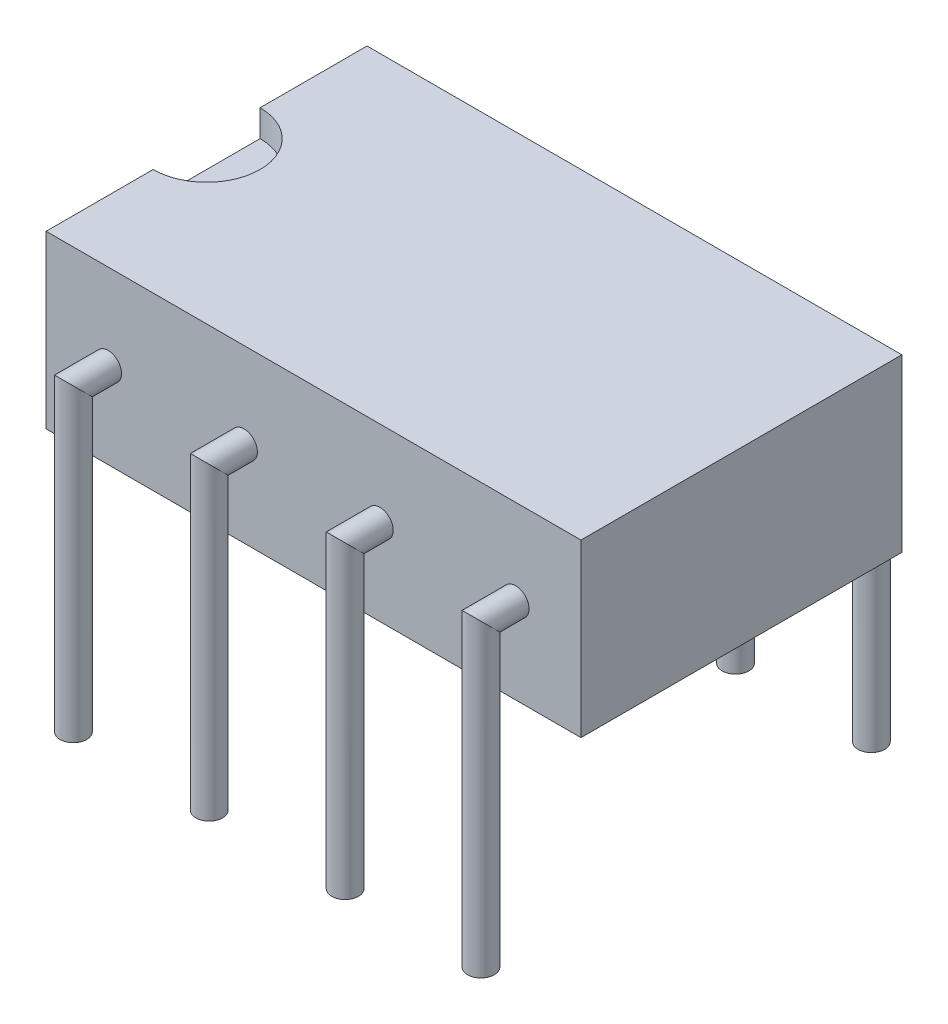
ISO-10303-21;
HEADER;
FILE_DESCRIPTION(('STEP AP214'),'2;1');
FILE_NAME('part.step','',(''),(''),'','','');
FILE_SCHEMA(('AUTOMOTIVE_DESIGN { 1 0 10303 214 1 1 1 1 }'));
ENDSEC;
DATA;
#1=APPLICATION_CONTEXT('core data for automotive mechanical design processes');
#2=APPLICATION_PROTOCOL_DEFINITION('international standard','automotive_design',2000,#1);
#3=PRODUCT_CONTEXT('',#1,'mechanical');
#4=PRODUCT('Part','Part','',(#3));
#5=PRODUCT_RELATED_PRODUCT_CATEGORY('part','',(#4));
#6=PRODUCT_DEFINITION_FORMATION('','',#4);
#7=PRODUCT_DEFINITION_CONTEXT('part definition',#1,'design');
#8=PRODUCT_DEFINITION('design','',#6,#7);
#9=PRODUCT_DEFINITION_SHAPE('','',#8);
#10=(LENGTH_UNIT() NAMED_UNIT(*) SI_UNIT(.MILLI.,.METRE.));
#11=(NAMED_UNIT(*) PLANE_ANGLE_UNIT() SI_UNIT($,.RADIAN.));
#12=(NAMED_UNIT(*) SI_UNIT($,.STERADIAN.) SOLID_ANGLE_UNIT());
#13=UNCERTAINTY_MEASURE_WITH_UNIT(LENGTH_MEASURE(1.E-05),#10,'distance_accuracy_value','');
#14=(GEOMETRIC_REPRESENTATION_CONTEXT(3) GLOBAL_UNCERTAINTY_ASSIGNED_CONTEXT((#13)) GLOBAL_UNIT_ASSIGNED_CONTEXT((#10,
#11,#12)) REPRESENTATION_CONTEXT('',''));
#15=CARTESIAN_POINT('',(0.,0.,0.));
#16=DIRECTION('',(0.,0.,1.));
#17=DIRECTION('',(1.,0.,0.));
#18=AXIS2_PLACEMENT_3D('',#15,#16,#17);
#19=CARTESIAN_POINT('',(10.,3.2,3.));
#20=DIRECTION('',(0.,0.,-1.));
#21=DIRECTION('',(-1.,0.,0.));
#22=AXIS2_PLACEMENT_3D('',#19,#20,#21);
#23=PLANE('',#22);
#24=CARTESIAN_POINT('',(6.24,1.6,3.));
#25=DIRECTION('',(0.,0.,-1.));
#26=DIRECTION('',(-1.,0.,0.));
#27=AXIS2_PLACEMENT_3D('',#24,#25,#26);
#28=CIRCLE('',#27,0.25);
#29=CARTESIAN_POINT('',(5.99,1.6,3.));
#30=VERTEX_POINT('',#29);
#31=EDGE_CURVE('E47',#30,#30,#28,.F.);
#32=ORIENTED_EDGE('',*,*,#31,.F.);
#33=EDGE_LOOP('',(#32));
#34=FACE_BOUND('',#33,.T.);
#35=CARTESIAN_POINT('',(1.16,1.6,3.));
#36=DIRECTION('',(0.,0.,1.));
#37=DIRECTION('',(1.,0.,0.));
#38=AXIS2_PLACEMENT_3D('',#35,#36,#37);
#39=CIRCLE('',#38,0.25);
#40=CARTESIAN_POINT('',(1.41,1.6,3.));
#41=VERTEX_POINT('',#40);
#42=EDGE_CURVE('E138',#41,#41,#39,.T.);
#43=ORIENTED_EDGE('',*,*,#42,.F.);
#44=EDGE_LOOP('',(#43));
#45=FACE_BOUND('',#44,.T.);
#46=DIRECTION('',(0.,-1.,0.));
#47=VECTOR('',#46,1.);
#48=CARTESIAN_POINT('',(0.,3.2,3.));
#49=LINE('',#48,#47);
#50=CARTESIAN_POINT('',(0.,3.2,3.));
#51=VERTEX_POINT('',#50);
#52=CARTESIAN_POINT('',(0.,0.,3.));
#53=VERTEX_POINT('',#52);
#54=EDGE_CURVE('E157',#51,#53,#49,.T.);
#55=ORIENTED_EDGE('',*,*,#54,.T.);
#56=DIRECTION('',(-1.,0.,0.));
#57=VECTOR('',#56,1.);
#58=CARTESIAN_POINT('',(10.,0.,3.));
#59=LINE('',#58,#57);
#60=CARTESIAN_POINT('',(10.,0.,3.));
#61=VERTEX_POINT('',#60);
#62=EDGE_CURVE('E135',#61,#53,#59,.T.);
#63=ORIENTED_EDGE('',*,*,#62,.F.);
#64=DIRECTION('',(0.,-1.,0.));
#65=VECTOR('',#64,1.);
#66=CARTESIAN_POINT('',(10.,3.2,3.));
#67=LINE('',#66,#65);
#68=CARTESIAN_POINT('',(10.,3.2,3.));
#69=VERTEX_POINT('',#68);
#70=EDGE_CURVE('E115',#69,#61,#67,.T.);
#71=ORIENTED_EDGE('',*,*,#70,.F.);
#72=DIRECTION('',(-1.,0.,0.));
#73=VECTOR('',#72,1.);
#74=CARTESIAN_POINT('',(10.,3.2,3.));
#75=LINE('',#74,#73);
#76=EDGE_CURVE('E128',#69,#51,#75,.T.);
#77=ORIENTED_EDGE('',*,*,#76,.T.);
#78=EDGE_LOOP('',(#55,#63,#71,#77));
#79=FACE_BOUND('',#78,.T.);
#80=CARTESIAN_POINT('',(3.7,1.6,3.));
#81=DIRECTION('',(0.,0.,-1.));
#82=DIRECTION('',(-1.,0.,0.));
#83=AXIS2_PLACEMENT_3D('',#80,#81,#82);
#84=CIRCLE('',#83,0.25);
#85=CARTESIAN_POINT('',(3.45,1.6,3.));
#86=VERTEX_POINT('',#85);
#87=EDGE_CURVE('E139',#86,#86,#84,.F.);
#88=ORIENTED_EDGE('',*,*,#87,.F.);
#89=EDGE_LOOP('',(#88));
#90=FACE_BOUND('',#89,.T.);
#91=CARTESIAN_POINT('',(8.78,1.6,3.));
#92=DIRECTION('',(0.,0.,-1.));
#93=DIRECTION('',(-1.,0.,0.));
#94=AXIS2_PLACEMENT_3D('',#91,#92,#93);
#95=CIRCLE('',#94,0.25);
#96=CARTESIAN_POINT('',(8.53,1.6,3.));
#97=VERTEX_POINT('',#96);
#98=EDGE_CURVE('E12',#97,#97,#95,.F.);
#99=ORIENTED_EDGE('',*,*,#98,.F.);
#100=EDGE_LOOP('',(#99));
#101=FACE_BOUND('',#100,.T.);
#102=ADVANCED_FACE('F40',(#34,#45,#79,#90,#101),#23,.F.);
#103=CARTESIAN_POINT('',(10.,0.,3.));
#104=DIRECTION('',(0.,1.,0.));
#105=DIRECTION('',(0.,0.,1.));
#106=AXIS2_PLACEMENT_3D('',#103,#104,#105);
#107=PLANE('',#106);
#108=DIRECTION('',(0.,0.,-1.));
#109=VECTOR('',#108,1.);
#110=CARTESIAN_POINT('',(0.,0.,3.));
#111=LINE('',#110,#109);
#112=CARTESIAN_POINT('',(0.,0.,-3.));
#113=VERTEX_POINT('',#112);
#114=EDGE_CURVE('E212',#53,#113,#111,.T.);
#115=ORIENTED_EDGE('',*,*,#114,.T.);
#116=DIRECTION('',(-1.,0.,0.));
#117=VECTOR('',#116,1.);
#118=CARTESIAN_POINT('',(10.,0.,-3.));
#119=LINE('',#118,#117);
#120=CARTESIAN_POINT('',(10.,0.,-3.));
#121=VERTEX_POINT('',#120);
#122=EDGE_CURVE('E132',#121,#113,#119,.T.);
#123=ORIENTED_EDGE('',*,*,#122,.F.);
#124=DIRECTION('',(0.,0.,-1.));
#125=VECTOR('',#124,1.);
#126=CARTESIAN_POINT('',(10.,0.,3.));
#127=LINE('',#126,#125);
#128=EDGE_CURVE('E118',#61,#121,#127,.T.);
#129=ORIENTED_EDGE('',*,*,#128,.F.);
#130=ORIENTED_EDGE('',*,*,#62,.T.);
#131=EDGE_LOOP('',(#115,#123,#129,#130));
#132=FACE_BOUND('',#131,.T.);
#133=ADVANCED_FACE('F149',(#132),#107,.F.);
#134=CARTESIAN_POINT('',(10.,3.2,-3.));
#135=DIRECTION('',(0.,0.,1.));
#136=DIRECTION('',(1.,0.,0.));
#137=AXIS2_PLACEMENT_3D('',#134,#135,#136);
#138=PLANE('',#137);
#139=CARTESIAN_POINT('',(8.78,1.6,-3.));
#140=DIRECTION('',(0.,0.,1.));
#141=DIRECTION('',(1.,0.,0.));
#142=AXIS2_PLACEMENT_3D('',#139,#140,#141);
#143=CIRCLE('',#142,0.25);
#144=CARTESIAN_POINT('',(9.03,1.6,-3.));
#145=VERTEX_POINT('',#144);
#146=EDGE_CURVE('E519',#145,#145,#143,.T.);
#147=ORIENTED_EDGE('',*,*,#146,.T.);
#148=EDGE_LOOP('',(#147));
#149=FACE_BOUND('',#148,.T.);
#150=CARTESIAN_POINT('',(6.24,1.6,-3.));
#151=DIRECTION('',(0.,0.,1.));
#152=DIRECTION('',(1.,0.,0.));
#153=AXIS2_PLACEMENT_3D('',#150,#151,#152);
#154=CIRCLE('',#153,0.25);
#155=CARTESIAN_POINT('',(6.49,1.6,-3.));
#156=VERTEX_POINT('',#155);
#157=EDGE_CURVE('E512',#156,#156,#154,.T.);
#158=ORIENTED_EDGE('',*,*,#157,.T.);
#159=EDGE_LOOP('',(#158));
#160=FACE_BOUND('',#159,.T.);
#161=CARTESIAN_POINT('',(3.7,1.6,-3.));
#162=DIRECTION('',(0.,0.,1.));
#163=DIRECTION('',(1.,0.,0.));
#164=AXIS2_PLACEMENT_3D('',#161,#162,#163);
#165=CIRCLE('',#164,0.25);
#166=CARTESIAN_POINT('',(3.95,1.6,-3.));
#167=VERTEX_POINT('',#166);
#168=EDGE_CURVE('E528',#167,#167,#165,.T.);
#169=ORIENTED_EDGE('',*,*,#168,.T.);
#170=EDGE_LOOP('',(#169));
#171=FACE_BOUND('',#170,.T.);
#172=CARTESIAN_POINT('',(1.16,1.6,-3.));
#173=DIRECTION('',(0.,0.,1.));
#174=DIRECTION('',(1.,0.,0.));
#175=AXIS2_PLACEMENT_3D('',#172,#173,#174);
#176=CIRCLE('',#175,0.25);
#177=CARTESIAN_POINT('',(1.41,1.6,-3.));
#178=VERTEX_POINT('',#177);
#179=EDGE_CURVE('E194',#178,#178,#176,.T.);
#180=ORIENTED_EDGE('',*,*,#179,.T.);
#181=EDGE_LOOP('',(#180));
#182=FACE_BOUND('',#181,.T.);
#183=DIRECTION('',(0.,1.,0.));
#184=VECTOR('',#183,1.);
#185=CARTESIAN_POINT('',(0.,3.2,-3.));
#186=LINE('',#185,#184);
#187=CARTESIAN_POINT('',(0.,3.2,-3.));
#188=VERTEX_POINT('',#187);
#189=EDGE_CURVE('E120',#113,#188,#186,.T.);
#190=ORIENTED_EDGE('',*,*,#189,.T.);
#191=DIRECTION('',(-1.,0.,0.));
#192=VECTOR('',#191,1.);
#193=CARTESIAN_POINT('',(10.,3.2,-3.));
#194=LINE('',#193,#192);
#195=CARTESIAN_POINT('',(10.,3.2,-3.));
#196=VERTEX_POINT('',#195);
#197=EDGE_CURVE('E114',#196,#188,#194,.T.);
#198=ORIENTED_EDGE('',*,*,#197,.F.);
#199=DIRECTION('',(0.,1.,0.));
#200=VECTOR('',#199,1.);
#201=CARTESIAN_POINT('',(10.,3.2,-3.));
#202=LINE('',#201,#200);
#203=EDGE_CURVE('E125',#121,#196,#202,.T.);
#204=ORIENTED_EDGE('',*,*,#203,.F.);
#205=ORIENTED_EDGE('',*,*,#122,.T.);
#206=EDGE_LOOP('',(#190,#198,#204,#205));
#207=FACE_BOUND('',#206,.T.);
#208=ADVANCED_FACE('F216',(#149,#160,#171,#182,#207),#138,.F.);
#209=CARTESIAN_POINT('',(10.,3.2,3.));
#210=DIRECTION('',(0.,-1.,0.));
#211=DIRECTION('',(0.,0.,-1.));
#212=AXIS2_PLACEMENT_3D('',#209,#210,#211);
#213=PLANE('',#212);
#214=DIRECTION('',(0.,0.,1.));
#215=VECTOR('',#214,1.);
#216=CARTESIAN_POINT('',(0.,3.2,3.));
#217=LINE('',#216,#215);
#218=CARTESIAN_POINT('',(0.,3.2,-1.));
#219=VERTEX_POINT('',#218);
#220=EDGE_CURVE('E108',#188,#219,#217,.T.);
#221=ORIENTED_EDGE('',*,*,#220,.T.);
#222=CARTESIAN_POINT('',(0.,3.2,0.));
#223=DIRECTION('',(0.,1.,0.));
#224=DIRECTION('',(0.,0.,1.));
#225=AXIS2_PLACEMENT_3D('',#222,#223,#224);
#226=CIRCLE('',#225,1.);
#227=CARTESIAN_POINT('',(0.,3.2,1.));
#228=VERTEX_POINT('',#227);
#229=EDGE_CURVE('E92',#228,#219,#226,.T.);
#230=ORIENTED_EDGE('',*,*,#229,.F.);
#231=EDGE_CURVE('E116',#228,#51,#217,.T.);
#232=ORIENTED_EDGE('',*,*,#231,.T.);
#233=ORIENTED_EDGE('',*,*,#76,.F.);
#234=DIRECTION('',(0.,0.,1.));
#235=VECTOR('',#234,1.);
#236=CARTESIAN_POINT('',(10.,3.2,3.));
#237=LINE('',#236,#235);
#238=EDGE_CURVE('E61',#196,#69,#237,.T.);
#239=ORIENTED_EDGE('',*,*,#238,.F.);
#240=ORIENTED_EDGE('',*,*,#197,.T.);
#241=EDGE_LOOP('',(#221,#230,#232,#233,#239,#240));
#242=FACE_BOUND('',#241,.T.);
#243=ADVANCED_FACE('F112',(#242),#213,.F.);
#244=CARTESIAN_POINT('',(10.,0.,3.));
#245=DIRECTION('',(1.,0.,0.));
#246=DIRECTION('',(0.,0.,-1.));
#247=AXIS2_PLACEMENT_3D('',#244,#245,#246);
#248=PLANE('',#247);
#249=ORIENTED_EDGE('',*,*,#70,.T.);
#250=ORIENTED_EDGE('',*,*,#128,.T.);
#251=ORIENTED_EDGE('',*,*,#203,.T.);
#252=ORIENTED_EDGE('',*,*,#238,.T.);
#253=EDGE_LOOP('',(#249,#250,#251,#252));
#254=FACE_BOUND('',#253,.T.);
#255=ADVANCED_FACE('F219',(#254),#248,.T.);
#256=CARTESIAN_POINT('',(0.,0.,3.));
#257=DIRECTION('',(1.,0.,0.));
#258=DIRECTION('',(0.,0.,-1.));
#259=AXIS2_PLACEMENT_3D('',#256,#257,#258);
#260=PLANE('',#259);
#261=DIRECTION('',(0.,0.,1.));
#262=VECTOR('',#261,1.);
#263=CARTESIAN_POINT('',(0.,2.7,-1.));
#264=LINE('',#263,#262);
#265=CARTESIAN_POINT('',(0.,2.7,-1.));
#266=VERTEX_POINT('',#265);
#267=CARTESIAN_POINT('',(0.,2.7,1.));
#268=VERTEX_POINT('',#267);
#269=EDGE_CURVE('E109',#266,#268,#264,.T.);
#270=ORIENTED_EDGE('',*,*,#269,.F.);
#271=DIRECTION('',(0.,1.,0.));
#272=VECTOR('',#271,1.);
#273=CARTESIAN_POINT('',(0.,2.7,-1.));
#274=LINE('',#273,#272);
#275=EDGE_CURVE('E95',#266,#219,#274,.T.);
#276=ORIENTED_EDGE('',*,*,#275,.T.);
#277=ORIENTED_EDGE('',*,*,#220,.F.);
#278=ORIENTED_EDGE('',*,*,#189,.F.);
#279=ORIENTED_EDGE('',*,*,#114,.F.);
#280=ORIENTED_EDGE('',*,*,#54,.F.);
#281=ORIENTED_EDGE('',*,*,#231,.F.);
#282=DIRECTION('',(0.,1.,0.));
#283=VECTOR('',#282,1.);
#284=CARTESIAN_POINT('',(0.,2.7,1.));
#285=LINE('',#284,#283);
#286=EDGE_CURVE('E98',#268,#228,#285,.T.);
#287=ORIENTED_EDGE('',*,*,#286,.F.);
#288=EDGE_LOOP('',(#270,#276,#277,#278,#279,#280,#281,#287));
#289=FACE_BOUND('',#288,.T.);
#290=ADVANCED_FACE('F106',(#289),#260,.F.);
#291=CARTESIAN_POINT('',(0.,2.7,0.));
#292=DIRECTION('',(0.,1.,0.));
#293=DIRECTION('',(0.,0.,1.));
#294=AXIS2_PLACEMENT_3D('',#291,#292,#293);
#295=CYLINDRICAL_SURFACE('',#294,1.);
#296=ORIENTED_EDGE('',*,*,#229,.T.);
#297=ORIENTED_EDGE('',*,*,#275,.F.);
#298=CARTESIAN_POINT('',(0.,2.7,0.));
#299=DIRECTION('',(0.,1.,0.));
#300=DIRECTION('',(0.,0.,1.));
#301=AXIS2_PLACEMENT_3D('',#298,#299,#300);
#302=CIRCLE('',#301,1.);
#303=EDGE_CURVE('E53',#268,#266,#302,.T.);
#304=ORIENTED_EDGE('',*,*,#303,.F.);
#305=ORIENTED_EDGE('',*,*,#286,.T.);
#306=EDGE_LOOP('',(#296,#297,#304,#305));
#307=FACE_BOUND('',#306,.T.);
#308=ADVANCED_FACE('F94',(#307),#295,.F.);
#309=CARTESIAN_POINT('',(0.,2.7,0.));
#310=DIRECTION('',(0.,1.,0.));
#311=DIRECTION('',(0.,0.,1.));
#312=AXIS2_PLACEMENT_3D('',#309,#310,#311);
#313=PLANE('',#312);
#314=ORIENTED_EDGE('',*,*,#303,.T.);
#315=ORIENTED_EDGE('',*,*,#269,.T.);
#316=EDGE_LOOP('',(#314,#315));
#317=FACE_BOUND('',#316,.T.);
#318=ADVANCED_FACE('F263',(#317),#313,.T.);
#319=CARTESIAN_POINT('',(1.16,1.6,3.65));
#320=DIRECTION('',(0.,-1.,0.));
#321=DIRECTION('',(0.,0.,-1.));
#322=AXIS2_PLACEMENT_3D('',#319,#320,#321);
#323=CYLINDRICAL_SURFACE('',#322,0.25);
#324=CARTESIAN_POINT('',(1.16,1.6,3.65));
#325=DIRECTION('',(0.,-0.707106781186548,0.707106781186547));
#326=DIRECTION('',(0.,-0.707106781186547,-0.707106781186548));
#327=AXIS2_PLACEMENT_3D('',#324,#325,#326);
#328=ELLIPSE('',#327,0.353553390593274,0.25);
#329=CARTESIAN_POINT('',(1.16,1.35,3.4));
#330=VERTEX_POINT('',#329);
#331=EDGE_CURVE('E203',#330,#330,#328,.T.);
#332=ORIENTED_EDGE('',*,*,#331,.T.);
#333=EDGE_LOOP('',(#332));
#334=FACE_BOUND('',#333,.T.);
#335=CARTESIAN_POINT('',(1.16,-4.,3.65));
#336=DIRECTION('',(0.,-1.,0.));
#337=DIRECTION('',(0.,0.,-1.));
#338=AXIS2_PLACEMENT_3D('',#335,#336,#337);
#339=CIRCLE('',#338,0.25);
#340=CARTESIAN_POINT('',(1.16,-4.,3.4));
#341=VERTEX_POINT('',#340);
#342=EDGE_CURVE('E102',#341,#341,#339,.F.);
#343=ORIENTED_EDGE('',*,*,#342,.T.);
#344=EDGE_LOOP('',(#343));
#345=FACE_BOUND('',#344,.T.);
#346=ADVANCED_FACE('F271',(#334,#345),#323,.T.);
#347=CARTESIAN_POINT('',(1.16,1.6,4.35710678118655));
#348=DIRECTION('',(0.,0.,-1.));
#349=DIRECTION('',(0.,1.,0.));
#350=AXIS2_PLACEMENT_3D('',#347,#348,#349);
#351=CYLINDRICAL_SURFACE('',#350,0.25);
#352=ORIENTED_EDGE('',*,*,#42,.T.);
#353=EDGE_LOOP('',(#352));
#354=FACE_BOUND('',#353,.T.);
#355=ORIENTED_EDGE('',*,*,#331,.F.);
#356=EDGE_LOOP('',(#355));
#357=FACE_BOUND('',#356,.T.);
#358=ADVANCED_FACE('F280',(#354,#357),#351,.T.);
#359=CARTESIAN_POINT('',(1.16,-4.,3.65));
#360=DIRECTION('',(0.,-1.,0.));
#361=DIRECTION('',(0.,0.,-1.));
#362=AXIS2_PLACEMENT_3D('',#359,#360,#361);
#363=PLANE('',#362);
#364=ORIENTED_EDGE('',*,*,#342,.F.);
#365=EDGE_LOOP('',(#364));
#366=FACE_BOUND('',#365,.T.);
#367=ADVANCED_FACE('F290',(#366),#363,.T.);
#368=CARTESIAN_POINT('',(1.16,1.6,-3.65));
#369=DIRECTION('',(0.,-1.,0.));
#370=DIRECTION('',(0.,0.,-1.));
#371=AXIS2_PLACEMENT_3D('',#368,#369,#370);
#372=CYLINDRICAL_SURFACE('',#371,0.25);
#373=CARTESIAN_POINT('',(1.16,1.6,-3.65));
#374=DIRECTION('',(0.,-0.707106781186548,-0.707106781186547));
#375=DIRECTION('',(0.,-0.707106781186547,0.707106781186548));
#376=AXIS2_PLACEMENT_3D('',#373,#374,#375);
#377=ELLIPSE('',#376,0.353553390593274,0.25);
#378=CARTESIAN_POINT('',(1.16,1.35,-3.4));
#379=VERTEX_POINT('',#378);
#380=EDGE_CURVE('E197',#379,#379,#377,.F.);
#381=ORIENTED_EDGE('',*,*,#380,.F.);
#382=EDGE_LOOP('',(#381));
#383=FACE_BOUND('',#382,.T.);
#384=CARTESIAN_POINT('',(1.16,-4.,-3.65));
#385=DIRECTION('',(0.,-1.,0.));
#386=DIRECTION('',(0.,0.,-1.));
#387=AXIS2_PLACEMENT_3D('',#384,#385,#386);
#388=CIRCLE('',#387,0.25);
#389=CARTESIAN_POINT('',(1.16,-4.,-3.9));
#390=VERTEX_POINT('',#389);
#391=EDGE_CURVE('E200',#390,#390,#388,.T.);
#392=ORIENTED_EDGE('',*,*,#391,.F.);
#393=EDGE_LOOP('',(#392));
#394=FACE_BOUND('',#393,.T.);
#395=ADVANCED_FACE('F300',(#383,#394),#372,.T.);
#396=CARTESIAN_POINT('',(1.16,1.6,-4.35710678118655));
#397=DIRECTION('',(0.,0.,1.));
#398=DIRECTION('',(0.,-1.,0.));
#399=AXIS2_PLACEMENT_3D('',#396,#397,#398);
#400=CYLINDRICAL_SURFACE('',#399,0.25);
#401=ORIENTED_EDGE('',*,*,#179,.F.);
#402=EDGE_LOOP('',(#401));
#403=FACE_BOUND('',#402,.T.);
#404=ORIENTED_EDGE('',*,*,#380,.T.);
#405=EDGE_LOOP('',(#404));
#406=FACE_BOUND('',#405,.T.);
#407=ADVANCED_FACE('F310',(#403,#406),#400,.T.);
#408=CARTESIAN_POINT('',(1.16,-4.,-3.65));
#409=DIRECTION('',(0.,-1.,0.));
#410=DIRECTION('',(0.,0.,-1.));
#411=AXIS2_PLACEMENT_3D('',#408,#409,#410);
#412=PLANE('',#411);
#413=ORIENTED_EDGE('',*,*,#391,.T.);
#414=EDGE_LOOP('',(#413));
#415=FACE_BOUND('',#414,.T.);
#416=ADVANCED_FACE('F320',(#415),#412,.T.);
#417=CARTESIAN_POINT('',(3.7,1.6,3.65));
#418=DIRECTION('',(0.,-1.,0.));
#419=DIRECTION('',(0.,0.,-1.));
#420=AXIS2_PLACEMENT_3D('',#417,#418,#419);
#421=CYLINDRICAL_SURFACE('',#420,0.25);
#422=CARTESIAN_POINT('',(3.7,1.6,3.65));
#423=DIRECTION('',(0.,-0.707106781186548,0.707106781186547));
#424=DIRECTION('',(0.,-0.707106781186547,-0.707106781186548));
#425=AXIS2_PLACEMENT_3D('',#422,#423,#424);
#426=ELLIPSE('',#425,0.353553390593274,0.25);
#427=CARTESIAN_POINT('',(3.7,1.35,3.4));
#428=VERTEX_POINT('',#427);
#429=EDGE_CURVE('E188',#428,#428,#426,.T.);
#430=ORIENTED_EDGE('',*,*,#429,.T.);
#431=EDGE_LOOP('',(#430));
#432=FACE_BOUND('',#431,.T.);
#433=CARTESIAN_POINT('',(3.7,-4.,3.65));
#434=DIRECTION('',(0.,-1.,0.));
#435=DIRECTION('',(0.,0.,-1.));
#436=AXIS2_PLACEMENT_3D('',#433,#434,#435);
#437=CIRCLE('',#436,0.25);
#438=CARTESIAN_POINT('',(3.7,-4.,3.4));
#439=VERTEX_POINT('',#438);
#440=EDGE_CURVE('E191',#439,#439,#437,.F.);
#441=ORIENTED_EDGE('',*,*,#440,.T.);
#442=EDGE_LOOP('',(#441));
#443=FACE_BOUND('',#442,.T.);
#444=ADVANCED_FACE('F329',(#432,#443),#421,.T.);
#445=CARTESIAN_POINT('',(3.7,1.6,4.35710678118655));
#446=DIRECTION('',(0.,0.,-1.));
#447=DIRECTION('',(0.,1.,0.));
#448=AXIS2_PLACEMENT_3D('',#445,#446,#447);
#449=CYLINDRICAL_SURFACE('',#448,0.25);
#450=ORIENTED_EDGE('',*,*,#87,.T.);
#451=EDGE_LOOP('',(#450));
#452=FACE_BOUND('',#451,.T.);
#453=ORIENTED_EDGE('',*,*,#429,.F.);
#454=EDGE_LOOP('',(#453));
#455=FACE_BOUND('',#454,.T.);
#456=ADVANCED_FACE('F344',(#452,#455),#449,.T.);
#457=CARTESIAN_POINT('',(3.7,-4.,3.65));
#458=DIRECTION('',(0.,-1.,0.));
#459=DIRECTION('',(0.,0.,-1.));
#460=AXIS2_PLACEMENT_3D('',#457,#458,#459);
#461=PLANE('',#460);
#462=ORIENTED_EDGE('',*,*,#440,.F.);
#463=EDGE_LOOP('',(#462));
#464=FACE_BOUND('',#463,.T.);
#465=ADVANCED_FACE('F353',(#464),#461,.T.);
#466=CARTESIAN_POINT('',(6.24,1.6,3.65));
#467=DIRECTION('',(0.,-1.,0.));
#468=DIRECTION('',(0.,0.,-1.));
#469=AXIS2_PLACEMENT_3D('',#466,#467,#468);
#470=CYLINDRICAL_SURFACE('',#469,0.25);
#471=CARTESIAN_POINT('',(6.24,1.6,3.65));
#472=DIRECTION('',(0.,-0.707106781186548,0.707106781186547));
#473=DIRECTION('',(0.,-0.707106781186547,-0.707106781186548));
#474=AXIS2_PLACEMENT_3D('',#471,#472,#473);
#475=ELLIPSE('',#474,0.353553390593274,0.25);
#476=CARTESIAN_POINT('',(6.24,1.35,3.4));
#477=VERTEX_POINT('',#476);
#478=EDGE_CURVE('E176',#477,#477,#475,.T.);
#479=ORIENTED_EDGE('',*,*,#478,.T.);
#480=EDGE_LOOP('',(#479));
#481=FACE_BOUND('',#480,.T.);
#482=CARTESIAN_POINT('',(6.24,-4.,3.65));
#483=DIRECTION('',(0.,-1.,0.));
#484=DIRECTION('',(0.,0.,-1.));
#485=AXIS2_PLACEMENT_3D('',#482,#483,#484);
#486=CIRCLE('',#485,0.25);
#487=CARTESIAN_POINT('',(6.24,-4.,3.4));
#488=VERTEX_POINT('',#487);
#489=EDGE_CURVE('E185',#488,#488,#486,.F.);
#490=ORIENTED_EDGE('',*,*,#489,.T.);
#491=EDGE_LOOP('',(#490));
#492=FACE_BOUND('',#491,.T.);
#493=ADVANCED_FACE('F362',(#481,#492),#470,.T.);
#494=CARTESIAN_POINT('',(6.24,1.6,4.35710678118655));
#495=DIRECTION('',(0.,0.,-1.));
#496=DIRECTION('',(0.,1.,0.));
#497=AXIS2_PLACEMENT_3D('',#494,#495,#496);
#498=CYLINDRICAL_SURFACE('',#497,0.25);
#499=ORIENTED_EDGE('',*,*,#31,.T.);
#500=EDGE_LOOP('',(#499));
#501=FACE_BOUND('',#500,.T.);
#502=ORIENTED_EDGE('',*,*,#478,.F.);
#503=EDGE_LOOP('',(#502));
#504=FACE_BOUND('',#503,.T.);
#505=ADVANCED_FACE('F144',(#501,#504),#498,.T.);
#506=CARTESIAN_POINT('',(6.24,-4.,3.65));
#507=DIRECTION('',(0.,-1.,0.));
#508=DIRECTION('',(0.,0.,-1.));
#509=AXIS2_PLACEMENT_3D('',#506,#507,#508);
#510=PLANE('',#509);
#511=ORIENTED_EDGE('',*,*,#489,.F.);
#512=EDGE_LOOP('',(#511));
#513=FACE_BOUND('',#512,.T.);
#514=ADVANCED_FACE('F379',(#513),#510,.T.);
#515=CARTESIAN_POINT('',(8.78,1.6,3.65));
#516=DIRECTION('',(0.,-1.,0.));
#517=DIRECTION('',(0.,0.,-1.));
#518=AXIS2_PLACEMENT_3D('',#515,#516,#517);
#519=CYLINDRICAL_SURFACE('',#518,0.25);
#520=CARTESIAN_POINT('',(8.78,1.6,3.65));
#521=DIRECTION('',(0.,-0.707106781186548,0.707106781186547));
#522=DIRECTION('',(0.,-0.707106781186547,-0.707106781186548));
#523=AXIS2_PLACEMENT_3D('',#520,#521,#522);
#524=ELLIPSE('',#523,0.353553390593274,0.25);
#525=CARTESIAN_POINT('',(8.78,1.35,3.4));
#526=VERTEX_POINT('',#525);
#527=EDGE_CURVE('E170',#526,#526,#524,.T.);
#528=ORIENTED_EDGE('',*,*,#527,.T.);
#529=EDGE_LOOP('',(#528));
#530=FACE_BOUND('',#529,.T.);
#531=CARTESIAN_POINT('',(8.78,-4.,3.65));
#532=DIRECTION('',(0.,-1.,0.));
#533=DIRECTION('',(0.,0.,-1.));
#534=AXIS2_PLACEMENT_3D('',#531,#532,#533);
#535=CIRCLE('',#534,0.25);
#536=CARTESIAN_POINT('',(8.78,-4.,3.4));
#537=VERTEX_POINT('',#536);
#538=EDGE_CURVE('E172',#537,#537,#535,.F.);
#539=ORIENTED_EDGE('',*,*,#538,.T.);
#540=EDGE_LOOP('',(#539));
#541=FACE_BOUND('',#540,.T.);
#542=ADVANCED_FACE('F166',(#530,#541),#519,.T.);
#543=CARTESIAN_POINT('',(8.78,1.6,4.35710678118655));
#544=DIRECTION('',(0.,0.,-1.));
#545=DIRECTION('',(0.,1.,0.));
#546=AXIS2_PLACEMENT_3D('',#543,#544,#545);
#547=CYLINDRICAL_SURFACE('',#546,0.25);
#548=ORIENTED_EDGE('',*,*,#98,.T.);
#549=EDGE_LOOP('',(#548));
#550=FACE_BOUND('',#549,.T.);
#551=ORIENTED_EDGE('',*,*,#527,.F.);
#552=EDGE_LOOP('',(#551));
#553=FACE_BOUND('',#552,.T.);
#554=ADVANCED_FACE('F162',(#550,#553),#547,.T.);
#555=CARTESIAN_POINT('',(8.78,-4.,3.65));
#556=DIRECTION('',(0.,-1.,0.));
#557=DIRECTION('',(0.,0.,-1.));
#558=AXIS2_PLACEMENT_3D('',#555,#556,#557);
#559=PLANE('',#558);
#560=ORIENTED_EDGE('',*,*,#538,.F.);
#561=EDGE_LOOP('',(#560));
#562=FACE_BOUND('',#561,.T.);
#563=ADVANCED_FACE('F165',(#562),#559,.T.);
#564=CARTESIAN_POINT('',(3.7,1.6,-3.65));
#565=DIRECTION('',(0.,-1.,0.));
#566=DIRECTION('',(0.,0.,-1.));
#567=AXIS2_PLACEMENT_3D('',#564,#565,#566);
#568=CYLINDRICAL_SURFACE('',#567,0.25);
#569=CARTESIAN_POINT('',(3.7,1.6,-3.65));
#570=DIRECTION('',(0.,-0.707106781186548,-0.707106781186547));
#571=DIRECTION('',(0.,-0.707106781186547,0.707106781186548));
#572=AXIS2_PLACEMENT_3D('',#569,#570,#571);
#573=ELLIPSE('',#572,0.353553390593274,0.25);
#574=CARTESIAN_POINT('',(3.7,1.35,-3.4));
#575=VERTEX_POINT('',#574);
#576=EDGE_CURVE('E179',#575,#575,#573,.F.);
#577=ORIENTED_EDGE('',*,*,#576,.F.);
#578=EDGE_LOOP('',(#577));
#579=FACE_BOUND('',#578,.T.);
#580=CARTESIAN_POINT('',(3.7,-4.,-3.65));
#581=DIRECTION('',(0.,-1.,0.));
#582=DIRECTION('',(0.,0.,-1.));
#583=AXIS2_PLACEMENT_3D('',#580,#581,#582);
#584=CIRCLE('',#583,0.25);
#585=CARTESIAN_POINT('',(3.7,-4.,-3.9));
#586=VERTEX_POINT('',#585);
#587=EDGE_CURVE('E173',#586,#586,#584,.T.);
#588=ORIENTED_EDGE('',*,*,#587,.F.);
#589=EDGE_LOOP('',(#588));
#590=FACE_BOUND('',#589,.T.);
#591=ADVANCED_FACE('F407',(#579,#590),#568,.T.);
#592=CARTESIAN_POINT('',(3.7,1.6,-4.35710678118655));
#593=DIRECTION('',(0.,0.,1.));
#594=DIRECTION('',(0.,-1.,0.));
#595=AXIS2_PLACEMENT_3D('',#592,#593,#594);
#596=CYLINDRICAL_SURFACE('',#595,0.25);
#597=ORIENTED_EDGE('',*,*,#168,.F.);
#598=EDGE_LOOP('',(#597));
#599=FACE_BOUND('',#598,.T.);
#600=ORIENTED_EDGE('',*,*,#576,.T.);
#601=EDGE_LOOP('',(#600));
#602=FACE_BOUND('',#601,.T.);
#603=ADVANCED_FACE('F416',(#599,#602),#596,.T.);
#604=CARTESIAN_POINT('',(3.7,-4.,-3.65));
#605=DIRECTION('',(0.,-1.,0.));
#606=DIRECTION('',(0.,0.,-1.));
#607=AXIS2_PLACEMENT_3D('',#604,#605,#606);
#608=PLANE('',#607);
#609=ORIENTED_EDGE('',*,*,#587,.T.);
#610=EDGE_LOOP('',(#609));
#611=FACE_BOUND('',#610,.T.);
#612=ADVANCED_FACE('F425',(#611),#608,.T.);
#613=CARTESIAN_POINT('',(6.24,1.6,-3.65));
#614=DIRECTION('',(0.,-1.,0.));
#615=DIRECTION('',(0.,0.,-1.));
#616=AXIS2_PLACEMENT_3D('',#613,#614,#615);
#617=CYLINDRICAL_SURFACE('',#616,0.25);
#618=CARTESIAN_POINT('',(6.24,1.6,-3.65));
#619=DIRECTION('',(0.,-0.707106781186548,-0.707106781186547));
#620=DIRECTION('',(0.,-0.707106781186547,0.707106781186548));
#621=AXIS2_PLACEMENT_3D('',#618,#619,#620);
#622=ELLIPSE('',#621,0.353553390593274,0.25);
#623=CARTESIAN_POINT('',(6.24,1.35,-3.4));
#624=VERTEX_POINT('',#623);
#625=EDGE_CURVE('E516',#624,#624,#622,.F.);
#626=ORIENTED_EDGE('',*,*,#625,.F.);
#627=EDGE_LOOP('',(#626));
#628=FACE_BOUND('',#627,.T.);
#629=CARTESIAN_POINT('',(6.24,-4.,-3.65));
#630=DIRECTION('',(0.,-1.,0.));
#631=DIRECTION('',(0.,0.,-1.));
#632=AXIS2_PLACEMENT_3D('',#629,#630,#631);
#633=CIRCLE('',#632,0.25);
#634=CARTESIAN_POINT('',(6.24,-4.,-3.9));
#635=VERTEX_POINT('',#634);
#636=EDGE_CURVE('E525',#635,#635,#633,.T.);
#637=ORIENTED_EDGE('',*,*,#636,.F.);
#638=EDGE_LOOP('',(#637));
#639=FACE_BOUND('',#638,.T.);
#640=ADVANCED_FACE('F434',(#628,#639),#617,.T.);
#641=CARTESIAN_POINT('',(6.24,1.6,-4.35710678118655));
#642=DIRECTION('',(0.,0.,1.));
#643=DIRECTION('',(0.,-1.,0.));
#644=AXIS2_PLACEMENT_3D('',#641,#642,#643);
#645=CYLINDRICAL_SURFACE('',#644,0.25);
#646=ORIENTED_EDGE('',*,*,#157,.F.);
#647=EDGE_LOOP('',(#646));
#648=FACE_BOUND('',#647,.T.);
#649=ORIENTED_EDGE('',*,*,#625,.T.);
#650=EDGE_LOOP('',(#649));
#651=FACE_BOUND('',#650,.T.);
#652=ADVANCED_FACE('F443',(#648,#651),#645,.T.);
#653=CARTESIAN_POINT('',(6.24,-4.,-3.65));
#654=DIRECTION('',(0.,-1.,0.));
#655=DIRECTION('',(0.,0.,-1.));
#656=AXIS2_PLACEMENT_3D('',#653,#654,#655);
#657=PLANE('',#656);
#658=ORIENTED_EDGE('',*,*,#636,.T.);
#659=EDGE_LOOP('',(#658));
#660=FACE_BOUND('',#659,.T.);
#661=ADVANCED_FACE('F452',(#660),#657,.T.);
#662=CARTESIAN_POINT('',(8.78,1.6,-3.65));
#663=DIRECTION('',(0.,-1.,0.));
#664=DIRECTION('',(0.,0.,-1.));
#665=AXIS2_PLACEMENT_3D('',#662,#663,#664);
#666=CYLINDRICAL_SURFACE('',#665,0.25);
#667=CARTESIAN_POINT('',(8.78,1.6,-3.65));
#668=DIRECTION('',(0.,-0.707106781186548,-0.707106781186547));
#669=DIRECTION('',(0.,-0.707106781186547,0.707106781186548));
#670=AXIS2_PLACEMENT_3D('',#667,#668,#669);
#671=ELLIPSE('',#670,0.353553390593274,0.25);
#672=CARTESIAN_POINT('',(8.78,1.35,-3.4));
#673=VERTEX_POINT('',#672);
#674=EDGE_CURVE('E513',#673,#673,#671,.F.);
#675=ORIENTED_EDGE('',*,*,#674,.F.);
#676=EDGE_LOOP('',(#675));
#677=FACE_BOUND('',#676,.T.);
#678=CARTESIAN_POINT('',(8.78,-4.,-3.65));
#679=DIRECTION('',(0.,-1.,0.));
#680=DIRECTION('',(0.,0.,-1.));
#681=AXIS2_PLACEMENT_3D('',#678,#679,#680);
#682=CIRCLE('',#681,0.25);
#683=CARTESIAN_POINT('',(8.78,-4.,-3.9));
#684=VERTEX_POINT('',#683);
#685=EDGE_CURVE('E510',#684,#684,#682,.T.);
#686=ORIENTED_EDGE('',*,*,#685,.F.);
#687=EDGE_LOOP('',(#686));
#688=FACE_BOUND('',#687,.T.);
#689=ADVANCED_FACE('F461',(#677,#688),#666,.T.);
#690=CARTESIAN_POINT('',(8.78,1.6,-4.35710678118655));
#691=DIRECTION('',(0.,0.,1.));
#692=DIRECTION('',(0.,-1.,0.));
#693=AXIS2_PLACEMENT_3D('',#690,#691,#692);
#694=CYLINDRICAL_SURFACE('',#693,0.25);
#695=ORIENTED_EDGE('',*,*,#146,.F.);
#696=EDGE_LOOP('',(#695));
#697=FACE_BOUND('',#696,.T.);
#698=ORIENTED_EDGE('',*,*,#674,.T.);
#699=EDGE_LOOP('',(#698));
#700=FACE_BOUND('',#699,.T.);
#701=ADVANCED_FACE('F470',(#697,#700),#694,.T.);
#702=CARTESIAN_POINT('',(8.78,-4.,-3.65));
#703=DIRECTION('',(0.,-1.,0.));
#704=DIRECTION('',(0.,0.,-1.));
#705=AXIS2_PLACEMENT_3D('',#702,#703,#704);
#706=PLANE('',#705);
#707=ORIENTED_EDGE('',*,*,#685,.T.);
#708=EDGE_LOOP('',(#707));
#709=FACE_BOUND('',#708,.T.);
#710=ADVANCED_FACE('F479',(#709),#706,.T.);
#711=CLOSED_SHELL('',(#102,#133,#208,#243,#255,#290,#308,#318,#346,#358,#367,#395,#407,#416,
#444,#456,#465,#493,#505,#514,#542,#554,#563,#591,#603,#612,#640,#652,#661,#689,#701,#710));
#712=MANIFOLD_SOLID_BREP('B2',#711);
#713=ADVANCED_BREP_SHAPE_REPRESENTATION('',(#18,#712),#14);
#714=SHAPE_DEFINITION_REPRESENTATION(#9,#713);
ENDSEC;
END-ISO-10303-21;
